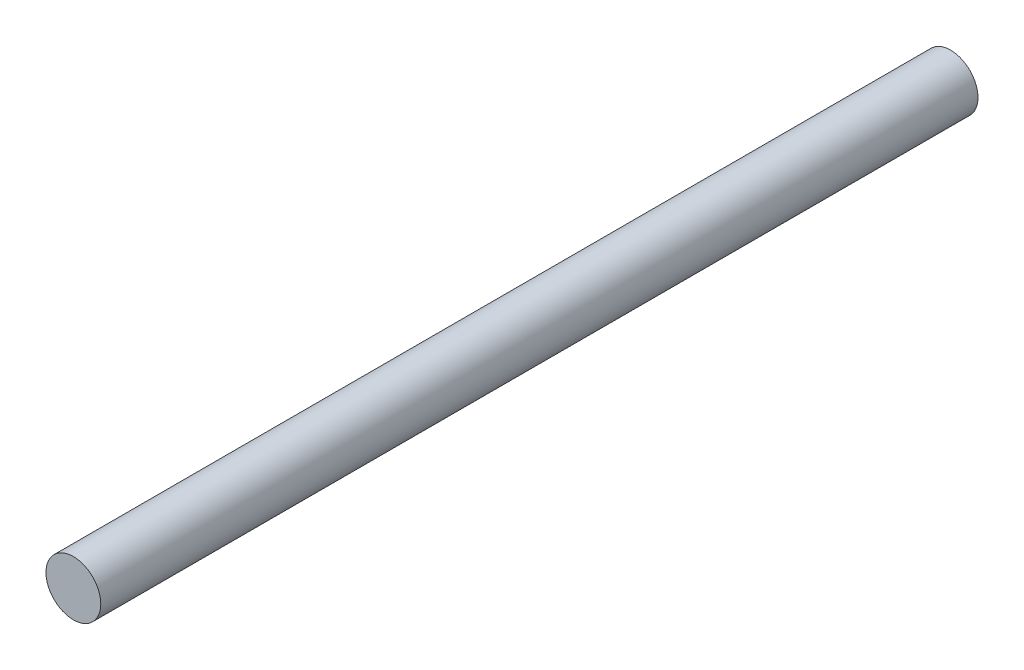
ISO-10303-21;
HEADER;
FILE_DESCRIPTION(('STEP AP214'),'2;1');
FILE_NAME('part.step','',(''),(''),'','','');
FILE_SCHEMA(('AUTOMOTIVE_DESIGN { 1 0 10303 214 1 1 1 1 }'));
ENDSEC;
DATA;
#1=APPLICATION_CONTEXT('core data for automotive mechanical design processes');
#2=APPLICATION_PROTOCOL_DEFINITION('international standard','automotive_design',2000,#1);
#3=PRODUCT_CONTEXT('',#1,'mechanical');
#4=PRODUCT('Part','Part','',(#3));
#5=PRODUCT_RELATED_PRODUCT_CATEGORY('part','',(#4));
#6=PRODUCT_DEFINITION_FORMATION('','',#4);
#7=PRODUCT_DEFINITION_CONTEXT('part definition',#1,'design');
#8=PRODUCT_DEFINITION('design','',#6,#7);
#9=PRODUCT_DEFINITION_SHAPE('','',#8);
#10=(LENGTH_UNIT() NAMED_UNIT(*) SI_UNIT(.MILLI.,.METRE.));
#11=(NAMED_UNIT(*) PLANE_ANGLE_UNIT() SI_UNIT($,.RADIAN.));
#12=(NAMED_UNIT(*) SI_UNIT($,.STERADIAN.) SOLID_ANGLE_UNIT());
#13=UNCERTAINTY_MEASURE_WITH_UNIT(LENGTH_MEASURE(1.E-05),#10,'distance_accuracy_value','');
#14=(GEOMETRIC_REPRESENTATION_CONTEXT(3) GLOBAL_UNCERTAINTY_ASSIGNED_CONTEXT((#13)) GLOBAL_UNIT_ASSIGNED_CONTEXT((#10,
#11,#12)) REPRESENTATION_CONTEXT('',''));
#15=CARTESIAN_POINT('',(0.,0.,0.));
#16=DIRECTION('',(0.,0.,1.));
#17=DIRECTION('',(1.,0.,0.));
#18=AXIS2_PLACEMENT_3D('',#15,#16,#17);
#19=CARTESIAN_POINT('',(0.,0.,80.));
#20=DIRECTION('',(0.,0.,-1.));
#21=DIRECTION('',(-1.,0.,0.));
#22=AXIS2_PLACEMENT_3D('',#19,#20,#21);
#23=CYLINDRICAL_SURFACE('',#22,2.5);
#24=CARTESIAN_POINT('',(0.,0.,80.));
#25=DIRECTION('',(0.,0.,1.));
#26=DIRECTION('',(1.,0.,0.));
#27=AXIS2_PLACEMENT_3D('',#24,#25,#26);
#28=CIRCLE('',#27,2.5);
#29=CARTESIAN_POINT('',(2.5,0.,80.));
#30=VERTEX_POINT('',#29);
#31=EDGE_CURVE('E10',#30,#30,#28,.T.);
#32=ORIENTED_EDGE('',*,*,#31,.F.);
#33=EDGE_LOOP('',(#32));
#34=FACE_BOUND('',#33,.T.);
#35=CARTESIAN_POINT('',(0.,0.,0.));
#36=DIRECTION('',(0.,0.,1.));
#37=DIRECTION('',(1.,0.,0.));
#38=AXIS2_PLACEMENT_3D('',#35,#36,#37);
#39=CIRCLE('',#38,2.5);
#40=CARTESIAN_POINT('',(2.5,0.,0.));
#41=VERTEX_POINT('',#40);
#42=EDGE_CURVE('E40',#41,#41,#39,.T.);
#43=ORIENTED_EDGE('',*,*,#42,.T.);
#44=EDGE_LOOP('',(#43));
#45=FACE_BOUND('',#44,.T.);
#46=ADVANCED_FACE('F37',(#34,#45),#23,.T.);
#47=CARTESIAN_POINT('',(0.,0.,80.));
#48=DIRECTION('',(0.,0.,1.));
#49=DIRECTION('',(1.,0.,0.));
#50=AXIS2_PLACEMENT_3D('',#47,#48,#49);
#51=PLANE('',#50);
#52=ORIENTED_EDGE('',*,*,#31,.T.);
#53=EDGE_LOOP('',(#52));
#54=FACE_BOUND('',#53,.T.);
#55=ADVANCED_FACE('F54',(#54),#51,.T.);
#56=CARTESIAN_POINT('',(0.,0.,0.));
#57=DIRECTION('',(0.,0.,1.));
#58=DIRECTION('',(1.,0.,0.));
#59=AXIS2_PLACEMENT_3D('',#56,#57,#58);
#60=PLANE('',#59);
#61=ORIENTED_EDGE('',*,*,#42,.F.);
#62=EDGE_LOOP('',(#61));
#63=FACE_BOUND('',#62,.T.);
#64=ADVANCED_FACE('F52',(#63),#60,.F.);
#65=CLOSED_SHELL('',(#46,#55,#64));
#66=MANIFOLD_SOLID_BREP('B2',#65);
#67=ADVANCED_BREP_SHAPE_REPRESENTATION('',(#18,#66),#14);
#68=SHAPE_DEFINITION_REPRESENTATION(#9,#67);
ENDSEC;
END-ISO-10303-21;
